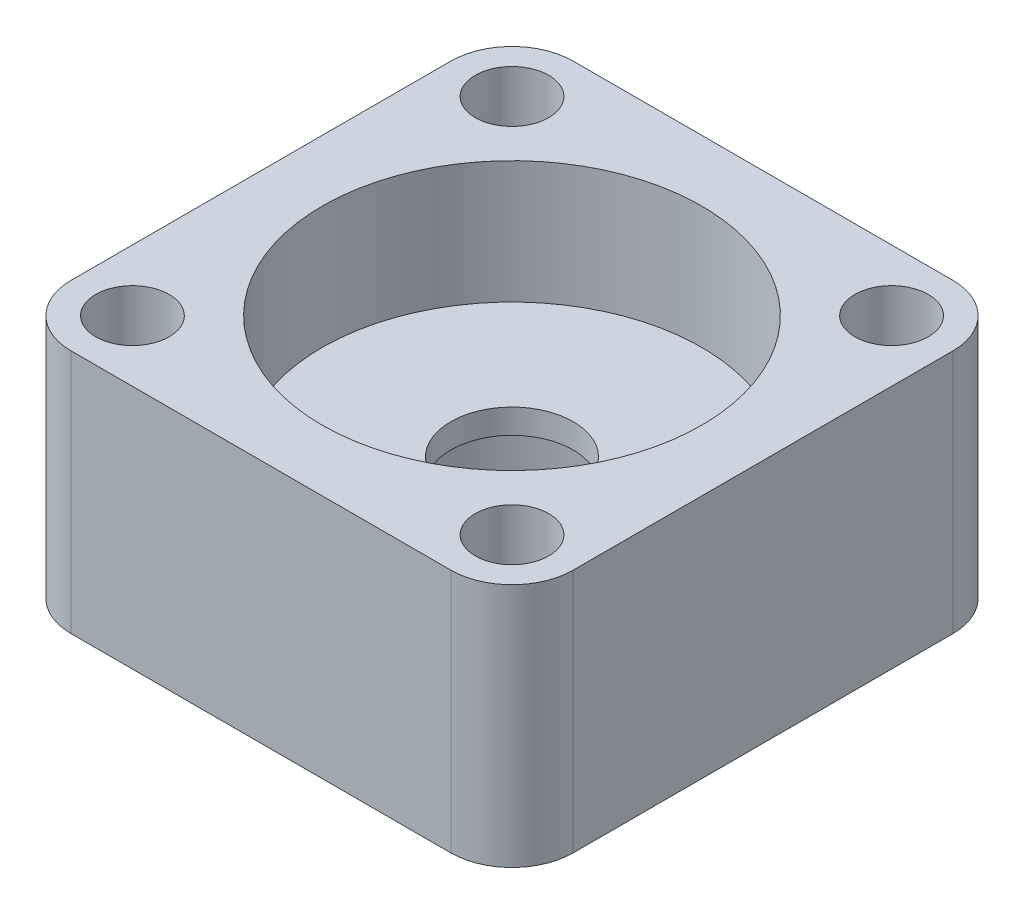
ISO-10303-21;
HEADER;
FILE_DESCRIPTION(('STEP AP214'),'2;1');
FILE_NAME('part.step','',(''),(''),'','','');
FILE_SCHEMA(('AUTOMOTIVE_DESIGN { 1 0 10303 214 1 1 1 1 }'));
ENDSEC;
DATA;
#1=APPLICATION_CONTEXT('core data for automotive mechanical design processes');
#2=APPLICATION_PROTOCOL_DEFINITION('international standard','automotive_design',2000,#1);
#3=PRODUCT_CONTEXT('',#1,'mechanical');
#4=PRODUCT('Part','Part','',(#3));
#5=PRODUCT_RELATED_PRODUCT_CATEGORY('part','',(#4));
#6=PRODUCT_DEFINITION_FORMATION('','',#4);
#7=PRODUCT_DEFINITION_CONTEXT('part definition',#1,'design');
#8=PRODUCT_DEFINITION('design','',#6,#7);
#9=PRODUCT_DEFINITION_SHAPE('','',#8);
#10=(LENGTH_UNIT() NAMED_UNIT(*) SI_UNIT(.MILLI.,.METRE.));
#11=(NAMED_UNIT(*) PLANE_ANGLE_UNIT() SI_UNIT($,.RADIAN.));
#12=(NAMED_UNIT(*) SI_UNIT($,.STERADIAN.) SOLID_ANGLE_UNIT());
#13=UNCERTAINTY_MEASURE_WITH_UNIT(LENGTH_MEASURE(1.E-05),#10,'distance_accuracy_value','');
#14=(GEOMETRIC_REPRESENTATION_CONTEXT(3) GLOBAL_UNCERTAINTY_ASSIGNED_CONTEXT((#13)) GLOBAL_UNIT_ASSIGNED_CONTEXT((#10,
#11,#12)) REPRESENTATION_CONTEXT('',''));
#15=CARTESIAN_POINT('',(0.,0.,0.));
#16=DIRECTION('',(0.,0.,1.));
#17=DIRECTION('',(1.,0.,0.));
#18=AXIS2_PLACEMENT_3D('',#15,#16,#17);
#19=CARTESIAN_POINT('',(-15.5,8.,-15.5));
#20=DIRECTION('',(0.,-1.,0.));
#21=DIRECTION('',(0.,0.,-1.));
#22=AXIS2_PLACEMENT_3D('',#19,#20,#21);
#23=CYLINDRICAL_SURFACE('',#22,1.75);
#24=CARTESIAN_POINT('',(-15.5,0.,-15.5));
#25=DIRECTION('',(0.,1.,0.));
#26=DIRECTION('',(0.,0.,1.));
#27=AXIS2_PLACEMENT_3D('',#24,#25,#26);
#28=CIRCLE('',#27,1.75);
#29=CARTESIAN_POINT('',(-15.5,0.,-13.75));
#30=VERTEX_POINT('',#29);
#31=EDGE_CURVE('E181',#30,#30,#28,.T.);
#32=ORIENTED_EDGE('',*,*,#31,.F.);
#33=EDGE_LOOP('',(#32));
#34=FACE_BOUND('',#33,.T.);
#35=CARTESIAN_POINT('',(-15.5,5.,-15.5));
#36=DIRECTION('',(0.,1.,0.));
#37=DIRECTION('',(0.,0.,1.));
#38=AXIS2_PLACEMENT_3D('',#35,#36,#37);
#39=CIRCLE('',#38,1.75);
#40=CARTESIAN_POINT('',(-15.5,5.,-13.75));
#41=VERTEX_POINT('',#40);
#42=EDGE_CURVE('E42',#41,#41,#39,.T.);
#43=ORIENTED_EDGE('',*,*,#42,.T.);
#44=EDGE_LOOP('',(#43));
#45=FACE_BOUND('',#44,.T.);
#46=ADVANCED_FACE('F38',(#34,#45),#23,.F.);
#47=CARTESIAN_POINT('',(15.5,8.,-15.5));
#48=DIRECTION('',(0.,-1.,0.));
#49=DIRECTION('',(0.,0.,-1.));
#50=AXIS2_PLACEMENT_3D('',#47,#48,#49);
#51=CYLINDRICAL_SURFACE('',#50,1.75);
#52=CARTESIAN_POINT('',(15.5,0.,-15.5));
#53=DIRECTION('',(0.,1.,0.));
#54=DIRECTION('',(0.,0.,1.));
#55=AXIS2_PLACEMENT_3D('',#52,#53,#54);
#56=CIRCLE('',#55,1.75);
#57=CARTESIAN_POINT('',(15.5,0.,-13.75));
#58=VERTEX_POINT('',#57);
#59=EDGE_CURVE('E177',#58,#58,#56,.T.);
#60=ORIENTED_EDGE('',*,*,#59,.F.);
#61=EDGE_LOOP('',(#60));
#62=FACE_BOUND('',#61,.T.);
#63=CARTESIAN_POINT('',(15.5,5.,-15.5));
#64=DIRECTION('',(0.,1.,0.));
#65=DIRECTION('',(0.,0.,1.));
#66=AXIS2_PLACEMENT_3D('',#63,#64,#65);
#67=CIRCLE('',#66,1.75);
#68=CARTESIAN_POINT('',(15.5,5.,-13.75));
#69=VERTEX_POINT('',#68);
#70=EDGE_CURVE('E244',#69,#69,#67,.T.);
#71=ORIENTED_EDGE('',*,*,#70,.T.);
#72=EDGE_LOOP('',(#71));
#73=FACE_BOUND('',#72,.T.);
#74=ADVANCED_FACE('F318',(#62,#73),#51,.F.);
#75=CARTESIAN_POINT('',(15.5,8.,15.5));
#76=DIRECTION('',(0.,-1.,0.));
#77=DIRECTION('',(0.,0.,-1.));
#78=AXIS2_PLACEMENT_3D('',#75,#76,#77);
#79=CYLINDRICAL_SURFACE('',#78,1.75);
#80=CARTESIAN_POINT('',(15.5,0.,15.5));
#81=DIRECTION('',(0.,1.,0.));
#82=DIRECTION('',(0.,0.,1.));
#83=AXIS2_PLACEMENT_3D('',#80,#81,#82);
#84=CIRCLE('',#83,1.75);
#85=CARTESIAN_POINT('',(15.5,0.,17.25));
#86=VERTEX_POINT('',#85);
#87=EDGE_CURVE('E173',#86,#86,#84,.T.);
#88=ORIENTED_EDGE('',*,*,#87,.F.);
#89=EDGE_LOOP('',(#88));
#90=FACE_BOUND('',#89,.T.);
#91=CARTESIAN_POINT('',(15.5,5.,15.5));
#92=DIRECTION('',(0.,1.,0.));
#93=DIRECTION('',(0.,0.,1.));
#94=AXIS2_PLACEMENT_3D('',#91,#92,#93);
#95=CIRCLE('',#94,1.75);
#96=CARTESIAN_POINT('',(15.5,5.,17.25));
#97=VERTEX_POINT('',#96);
#98=EDGE_CURVE('E240',#97,#97,#95,.T.);
#99=ORIENTED_EDGE('',*,*,#98,.T.);
#100=EDGE_LOOP('',(#99));
#101=FACE_BOUND('',#100,.T.);
#102=ADVANCED_FACE('F325',(#90,#101),#79,.F.);
#103=CARTESIAN_POINT('',(-15.5,8.,15.5));
#104=DIRECTION('',(0.,-1.,0.));
#105=DIRECTION('',(0.,0.,-1.));
#106=AXIS2_PLACEMENT_3D('',#103,#104,#105);
#107=CYLINDRICAL_SURFACE('',#106,1.75);
#108=CARTESIAN_POINT('',(-15.5,0.,15.5));
#109=DIRECTION('',(0.,1.,0.));
#110=DIRECTION('',(0.,0.,1.));
#111=AXIS2_PLACEMENT_3D('',#108,#109,#110);
#112=CIRCLE('',#111,1.75);
#113=CARTESIAN_POINT('',(-15.5,0.,17.25));
#114=VERTEX_POINT('',#113);
#115=EDGE_CURVE('E169',#114,#114,#112,.T.);
#116=ORIENTED_EDGE('',*,*,#115,.F.);
#117=EDGE_LOOP('',(#116));
#118=FACE_BOUND('',#117,.T.);
#119=CARTESIAN_POINT('',(-15.5,5.,15.5));
#120=DIRECTION('',(0.,1.,0.));
#121=DIRECTION('',(0.,0.,1.));
#122=AXIS2_PLACEMENT_3D('',#119,#120,#121);
#123=CIRCLE('',#122,1.75);
#124=CARTESIAN_POINT('',(-15.5,5.,17.25));
#125=VERTEX_POINT('',#124);
#126=EDGE_CURVE('E236',#125,#125,#123,.T.);
#127=ORIENTED_EDGE('',*,*,#126,.T.);
#128=EDGE_LOOP('',(#127));
#129=FACE_BOUND('',#128,.T.);
#130=ADVANCED_FACE('F378',(#118,#129),#107,.F.);
#131=CARTESIAN_POINT('',(-15.5,10.,-15.5));
#132=DIRECTION('',(0.,1.,0.));
#133=DIRECTION('',(0.,0.,1.));
#134=AXIS2_PLACEMENT_3D('',#131,#132,#133);
#135=PLANE('',#134);
#136=CARTESIAN_POINT('',(0.,10.,0.));
#137=DIRECTION('',(0.,1.,0.));
#138=DIRECTION('',(0.,0.,1.));
#139=AXIS2_PLACEMENT_3D('',#136,#137,#138);
#140=CIRCLE('',#139,5.);
#141=CARTESIAN_POINT('',(0.,10.,5.));
#142=VERTEX_POINT('',#141);
#143=EDGE_CURVE('E161',#142,#142,#140,.T.);
#144=ORIENTED_EDGE('',*,*,#143,.F.);
#145=EDGE_LOOP('',(#144));
#146=FACE_BOUND('',#145,.T.);
#147=CARTESIAN_POINT('',(0.,10.,0.));
#148=DIRECTION('',(0.,1.,0.));
#149=DIRECTION('',(0.,0.,1.));
#150=AXIS2_PLACEMENT_3D('',#147,#148,#149);
#151=CIRCLE('',#150,15.5);
#152=CARTESIAN_POINT('',(0.,10.,15.5));
#153=VERTEX_POINT('',#152);
#154=EDGE_CURVE('E11',#153,#153,#151,.F.);
#155=ORIENTED_EDGE('',*,*,#154,.F.);
#156=EDGE_LOOP('',(#155));
#157=FACE_BOUND('',#156,.T.);
#158=ADVANCED_FACE('F340',(#146,#157),#135,.T.);
#159=CARTESIAN_POINT('',(-15.5,0.,-15.5));
#160=DIRECTION('',(0.,1.,0.));
#161=DIRECTION('',(0.,0.,1.));
#162=AXIS2_PLACEMENT_3D('',#159,#160,#161);
#163=PLANE('',#162);
#164=CARTESIAN_POINT('',(-15.5,0.,-15.5));
#165=DIRECTION('',(0.,1.,0.));
#166=DIRECTION('',(0.,0.,1.));
#167=AXIS2_PLACEMENT_3D('',#164,#165,#166);
#168=CIRCLE('',#167,5.);
#169=CARTESIAN_POINT('',(-15.5,0.,-20.5));
#170=VERTEX_POINT('',#169);
#171=CARTESIAN_POINT('',(-20.5,0.,-15.5));
#172=VERTEX_POINT('',#171);
#173=EDGE_CURVE('E112',#170,#172,#168,.T.);
#174=ORIENTED_EDGE('',*,*,#173,.F.);
#175=DIRECTION('',(-1.,0.,0.));
#176=VECTOR('',#175,1.);
#177=CARTESIAN_POINT('',(-15.5,0.,-20.5));
#178=LINE('',#177,#176);
#179=CARTESIAN_POINT('',(15.5,0.,-20.5));
#180=VERTEX_POINT('',#179);
#181=EDGE_CURVE('E56',#180,#170,#178,.T.);
#182=ORIENTED_EDGE('',*,*,#181,.F.);
#183=CARTESIAN_POINT('',(15.5,0.,-15.5));
#184=DIRECTION('',(0.,1.,0.));
#185=DIRECTION('',(0.,0.,1.));
#186=AXIS2_PLACEMENT_3D('',#183,#184,#185);
#187=CIRCLE('',#186,4.99999999999999);
#188=CARTESIAN_POINT('',(20.5,0.,-15.5));
#189=VERTEX_POINT('',#188);
#190=EDGE_CURVE('E64',#189,#180,#187,.T.);
#191=ORIENTED_EDGE('',*,*,#190,.F.);
#192=DIRECTION('',(0.,0.,-1.));
#193=VECTOR('',#192,1.);
#194=CARTESIAN_POINT('',(20.5,0.,-15.5));
#195=LINE('',#194,#193);
#196=CARTESIAN_POINT('',(20.5,0.,15.5));
#197=VERTEX_POINT('',#196);
#198=EDGE_CURVE('E206',#197,#189,#195,.T.);
#199=ORIENTED_EDGE('',*,*,#198,.F.);
#200=CARTESIAN_POINT('',(15.5,0.,15.5));
#201=DIRECTION('',(0.,1.,0.));
#202=DIRECTION('',(0.,0.,1.));
#203=AXIS2_PLACEMENT_3D('',#200,#201,#202);
#204=CIRCLE('',#203,5.);
#205=CARTESIAN_POINT('',(15.5,0.,20.5));
#206=VERTEX_POINT('',#205);
#207=EDGE_CURVE('E203',#206,#197,#204,.T.);
#208=ORIENTED_EDGE('',*,*,#207,.F.);
#209=DIRECTION('',(1.,0.,0.));
#210=VECTOR('',#209,1.);
#211=CARTESIAN_POINT('',(-15.5,0.,20.5));
#212=LINE('',#211,#210);
#213=CARTESIAN_POINT('',(-15.5,0.,20.5));
#214=VERTEX_POINT('',#213);
#215=EDGE_CURVE('E200',#214,#206,#212,.T.);
#216=ORIENTED_EDGE('',*,*,#215,.F.);
#217=CARTESIAN_POINT('',(-15.5,0.,15.5));
#218=DIRECTION('',(0.,1.,0.));
#219=DIRECTION('',(0.,0.,1.));
#220=AXIS2_PLACEMENT_3D('',#217,#218,#219);
#221=CIRCLE('',#220,5.);
#222=CARTESIAN_POINT('',(-20.5,0.,15.5));
#223=VERTEX_POINT('',#222);
#224=EDGE_CURVE('E197',#223,#214,#221,.T.);
#225=ORIENTED_EDGE('',*,*,#224,.F.);
#226=DIRECTION('',(0.,0.,1.));
#227=VECTOR('',#226,1.);
#228=CARTESIAN_POINT('',(-20.5,0.,-15.5));
#229=LINE('',#228,#227);
#230=EDGE_CURVE('E194',#172,#223,#229,.T.);
#231=ORIENTED_EDGE('',*,*,#230,.F.);
#232=EDGE_LOOP('',(#174,#182,#191,#199,#208,#216,#225,#231));
#233=FACE_BOUND('',#232,.T.);
#234=CARTESIAN_POINT('',(0.,0.,0.));
#235=DIRECTION('',(0.,1.,0.));
#236=DIRECTION('',(0.,0.,1.));
#237=AXIS2_PLACEMENT_3D('',#234,#235,#236);
#238=CIRCLE('',#237,11.);
#239=CARTESIAN_POINT('',(0.,0.,11.));
#240=VERTEX_POINT('',#239);
#241=EDGE_CURVE('E185',#240,#240,#238,.T.);
#242=ORIENTED_EDGE('',*,*,#241,.T.);
#243=EDGE_LOOP('',(#242));
#244=FACE_BOUND('',#243,.T.);
#245=ORIENTED_EDGE('',*,*,#31,.T.);
#246=EDGE_LOOP('',(#245));
#247=FACE_BOUND('',#246,.T.);
#248=ORIENTED_EDGE('',*,*,#59,.T.);
#249=EDGE_LOOP('',(#248));
#250=FACE_BOUND('',#249,.T.);
#251=ORIENTED_EDGE('',*,*,#87,.T.);
#252=EDGE_LOOP('',(#251));
#253=FACE_BOUND('',#252,.T.);
#254=ORIENTED_EDGE('',*,*,#115,.T.);
#255=EDGE_LOOP('',(#254));
#256=FACE_BOUND('',#255,.T.);
#257=ADVANCED_FACE('F337',(#233,#244,#247,#250,#253,#256),#163,.F.);
#258=CARTESIAN_POINT('',(-15.5,8.,-15.5));
#259=DIRECTION('',(0.,-1.,0.));
#260=DIRECTION('',(0.,0.,-1.));
#261=AXIS2_PLACEMENT_3D('',#258,#259,#260);
#262=CYLINDRICAL_SURFACE('',#261,5.);
#263=ORIENTED_EDGE('',*,*,#173,.T.);
#264=DIRECTION('',(0.,-1.,0.));
#265=VECTOR('',#264,1.);
#266=CARTESIAN_POINT('',(-20.5,8.,-15.5));
#267=LINE('',#266,#265);
#268=CARTESIAN_POINT('',(-20.5,20.,-15.5));
#269=VERTEX_POINT('',#268);
#270=EDGE_CURVE('E48',#269,#172,#267,.T.);
#271=ORIENTED_EDGE('',*,*,#270,.F.);
#272=CARTESIAN_POINT('',(-15.5,20.,-15.5));
#273=DIRECTION('',(0.,1.,0.));
#274=DIRECTION('',(0.,0.,1.));
#275=AXIS2_PLACEMENT_3D('',#272,#273,#274);
#276=CIRCLE('',#275,5.);
#277=CARTESIAN_POINT('',(-15.5,20.,-20.5));
#278=VERTEX_POINT('',#277);
#279=EDGE_CURVE('E110',#278,#269,#276,.T.);
#280=ORIENTED_EDGE('',*,*,#279,.F.);
#281=DIRECTION('',(0.,-1.,0.));
#282=VECTOR('',#281,1.);
#283=CARTESIAN_POINT('',(-15.5,8.,-20.5));
#284=LINE('',#283,#282);
#285=EDGE_CURVE('E213',#278,#170,#284,.T.);
#286=ORIENTED_EDGE('',*,*,#285,.T.);
#287=EDGE_LOOP('',(#263,#271,#280,#286));
#288=FACE_BOUND('',#287,.T.);
#289=ADVANCED_FACE('F40',(#288),#262,.T.);
#290=CARTESIAN_POINT('',(-20.5,8.,-15.5));
#291=DIRECTION('',(1.,0.,0.));
#292=DIRECTION('',(0.,0.,-1.));
#293=AXIS2_PLACEMENT_3D('',#290,#291,#292);
#294=PLANE('',#293);
#295=ORIENTED_EDGE('',*,*,#230,.T.);
#296=DIRECTION('',(0.,-1.,0.));
#297=VECTOR('',#296,1.);
#298=CARTESIAN_POINT('',(-20.5,8.,15.5));
#299=LINE('',#298,#297);
#300=CARTESIAN_POINT('',(-20.5,20.,15.5));
#301=VERTEX_POINT('',#300);
#302=EDGE_CURVE('E115',#301,#223,#299,.T.);
#303=ORIENTED_EDGE('',*,*,#302,.F.);
#304=DIRECTION('',(0.,0.,1.));
#305=VECTOR('',#304,1.);
#306=CARTESIAN_POINT('',(-20.5,20.,-15.5));
#307=LINE('',#306,#305);
#308=EDGE_CURVE('E118',#269,#301,#307,.T.);
#309=ORIENTED_EDGE('',*,*,#308,.F.);
#310=ORIENTED_EDGE('',*,*,#270,.T.);
#311=EDGE_LOOP('',(#295,#303,#309,#310));
#312=FACE_BOUND('',#311,.T.);
#313=ADVANCED_FACE('F119',(#312),#294,.F.);
#314=CARTESIAN_POINT('',(-15.5,8.,15.5));
#315=DIRECTION('',(0.,-1.,0.));
#316=DIRECTION('',(0.,0.,-1.));
#317=AXIS2_PLACEMENT_3D('',#314,#315,#316);
#318=CYLINDRICAL_SURFACE('',#317,5.);
#319=ORIENTED_EDGE('',*,*,#224,.T.);
#320=DIRECTION('',(0.,-1.,0.));
#321=VECTOR('',#320,1.);
#322=CARTESIAN_POINT('',(-15.5,8.,20.5));
#323=LINE('',#322,#321);
#324=CARTESIAN_POINT('',(-15.5,20.,20.5));
#325=VERTEX_POINT('',#324);
#326=EDGE_CURVE('E230',#325,#214,#323,.T.);
#327=ORIENTED_EDGE('',*,*,#326,.F.);
#328=CARTESIAN_POINT('',(-15.5,20.,15.5));
#329=DIRECTION('',(0.,1.,0.));
#330=DIRECTION('',(0.,0.,1.));
#331=AXIS2_PLACEMENT_3D('',#328,#329,#330);
#332=CIRCLE('',#331,5.);
#333=EDGE_CURVE('E125',#301,#325,#332,.T.);
#334=ORIENTED_EDGE('',*,*,#333,.F.);
#335=ORIENTED_EDGE('',*,*,#302,.T.);
#336=EDGE_LOOP('',(#319,#327,#334,#335));
#337=FACE_BOUND('',#336,.T.);
#338=ADVANCED_FACE('F358',(#337),#318,.T.);
#339=CARTESIAN_POINT('',(-15.5,8.,20.5));
#340=DIRECTION('',(0.,0.,-1.));
#341=DIRECTION('',(-1.,0.,0.));
#342=AXIS2_PLACEMENT_3D('',#339,#340,#341);
#343=PLANE('',#342);
#344=ORIENTED_EDGE('',*,*,#215,.T.);
#345=DIRECTION('',(0.,-1.,0.));
#346=VECTOR('',#345,1.);
#347=CARTESIAN_POINT('',(15.5,8.,20.5));
#348=LINE('',#347,#346);
#349=CARTESIAN_POINT('',(15.5,20.,20.5));
#350=VERTEX_POINT('',#349);
#351=EDGE_CURVE('E226',#350,#206,#348,.T.);
#352=ORIENTED_EDGE('',*,*,#351,.F.);
#353=DIRECTION('',(1.,0.,0.));
#354=VECTOR('',#353,1.);
#355=CARTESIAN_POINT('',(-15.5,20.,20.5));
#356=LINE('',#355,#354);
#357=EDGE_CURVE('E143',#325,#350,#356,.T.);
#358=ORIENTED_EDGE('',*,*,#357,.F.);
#359=ORIENTED_EDGE('',*,*,#326,.T.);
#360=EDGE_LOOP('',(#344,#352,#358,#359));
#361=FACE_BOUND('',#360,.T.);
#362=ADVANCED_FACE('F354',(#361),#343,.F.);
#363=CARTESIAN_POINT('',(15.5,8.,15.5));
#364=DIRECTION('',(0.,-1.,0.));
#365=DIRECTION('',(0.,0.,-1.));
#366=AXIS2_PLACEMENT_3D('',#363,#364,#365);
#367=CYLINDRICAL_SURFACE('',#366,5.);
#368=ORIENTED_EDGE('',*,*,#207,.T.);
#369=DIRECTION('',(0.,-1.,0.));
#370=VECTOR('',#369,1.);
#371=CARTESIAN_POINT('',(20.5,8.,15.5));
#372=LINE('',#371,#370);
#373=CARTESIAN_POINT('',(20.5,20.,15.5));
#374=VERTEX_POINT('',#373);
#375=EDGE_CURVE('E222',#374,#197,#372,.T.);
#376=ORIENTED_EDGE('',*,*,#375,.F.);
#377=CARTESIAN_POINT('',(15.5,20.,15.5));
#378=DIRECTION('',(0.,1.,0.));
#379=DIRECTION('',(0.,0.,1.));
#380=AXIS2_PLACEMENT_3D('',#377,#378,#379);
#381=CIRCLE('',#380,5.);
#382=EDGE_CURVE('E147',#350,#374,#381,.T.);
#383=ORIENTED_EDGE('',*,*,#382,.F.);
#384=ORIENTED_EDGE('',*,*,#351,.T.);
#385=EDGE_LOOP('',(#368,#376,#383,#384));
#386=FACE_BOUND('',#385,.T.);
#387=ADVANCED_FACE('F350',(#386),#367,.T.);
#388=CARTESIAN_POINT('',(20.5,8.,-15.5));
#389=DIRECTION('',(-1.,0.,0.));
#390=DIRECTION('',(0.,0.,1.));
#391=AXIS2_PLACEMENT_3D('',#388,#389,#390);
#392=PLANE('',#391);
#393=ORIENTED_EDGE('',*,*,#198,.T.);
#394=DIRECTION('',(0.,-1.,0.));
#395=VECTOR('',#394,1.);
#396=CARTESIAN_POINT('',(20.5,8.,-15.5));
#397=LINE('',#396,#395);
#398=CARTESIAN_POINT('',(20.5,20.,-15.5));
#399=VERTEX_POINT('',#398);
#400=EDGE_CURVE('E219',#399,#189,#397,.T.);
#401=ORIENTED_EDGE('',*,*,#400,.F.);
#402=DIRECTION('',(0.,0.,-1.));
#403=VECTOR('',#402,1.);
#404=CARTESIAN_POINT('',(20.5,20.,15.5));
#405=LINE('',#404,#403);
#406=EDGE_CURVE('E151',#374,#399,#405,.T.);
#407=ORIENTED_EDGE('',*,*,#406,.F.);
#408=ORIENTED_EDGE('',*,*,#375,.T.);
#409=EDGE_LOOP('',(#393,#401,#407,#408));
#410=FACE_BOUND('',#409,.T.);
#411=ADVANCED_FACE('F347',(#410),#392,.F.);
#412=CARTESIAN_POINT('',(15.5,8.,-15.5));
#413=DIRECTION('',(0.,-1.,0.));
#414=DIRECTION('',(0.,0.,-1.));
#415=AXIS2_PLACEMENT_3D('',#412,#413,#414);
#416=CYLINDRICAL_SURFACE('',#415,4.99999999999999);
#417=ORIENTED_EDGE('',*,*,#190,.T.);
#418=DIRECTION('',(0.,-1.,0.));
#419=VECTOR('',#418,1.);
#420=CARTESIAN_POINT('',(15.5,8.,-20.5));
#421=LINE('',#420,#419);
#422=CARTESIAN_POINT('',(15.5,20.,-20.5));
#423=VERTEX_POINT('',#422);
#424=EDGE_CURVE('E216',#423,#180,#421,.T.);
#425=ORIENTED_EDGE('',*,*,#424,.F.);
#426=CARTESIAN_POINT('',(15.5,20.,-15.5));
#427=DIRECTION('',(0.,1.,0.));
#428=DIRECTION('',(0.,0.,1.));
#429=AXIS2_PLACEMENT_3D('',#426,#427,#428);
#430=CIRCLE('',#429,4.99999999999999);
#431=EDGE_CURVE('E155',#399,#423,#430,.T.);
#432=ORIENTED_EDGE('',*,*,#431,.F.);
#433=ORIENTED_EDGE('',*,*,#400,.T.);
#434=EDGE_LOOP('',(#417,#425,#432,#433));
#435=FACE_BOUND('',#434,.T.);
#436=ADVANCED_FACE('F344',(#435),#416,.T.);
#437=CARTESIAN_POINT('',(-15.5,8.,-20.5));
#438=DIRECTION('',(0.,0.,1.));
#439=DIRECTION('',(1.,0.,0.));
#440=AXIS2_PLACEMENT_3D('',#437,#438,#439);
#441=PLANE('',#440);
#442=ORIENTED_EDGE('',*,*,#181,.T.);
#443=ORIENTED_EDGE('',*,*,#285,.F.);
#444=DIRECTION('',(-1.,0.,0.));
#445=VECTOR('',#444,1.);
#446=CARTESIAN_POINT('',(15.5,20.,-20.5));
#447=LINE('',#446,#445);
#448=EDGE_CURVE('E132',#423,#278,#447,.T.);
#449=ORIENTED_EDGE('',*,*,#448,.F.);
#450=ORIENTED_EDGE('',*,*,#424,.T.);
#451=EDGE_LOOP('',(#442,#443,#449,#450));
#452=FACE_BOUND('',#451,.T.);
#453=ADVANCED_FACE('F335',(#452),#441,.F.);
#454=CARTESIAN_POINT('',(0.,8.,0.));
#455=DIRECTION('',(0.,-1.,0.));
#456=DIRECTION('',(0.,0.,-1.));
#457=AXIS2_PLACEMENT_3D('',#454,#455,#456);
#458=CYLINDRICAL_SURFACE('',#457,11.);
#459=CARTESIAN_POINT('',(0.,8.,0.));
#460=DIRECTION('',(0.,1.,0.));
#461=DIRECTION('',(0.,0.,1.));
#462=AXIS2_PLACEMENT_3D('',#459,#460,#461);
#463=CIRCLE('',#462,11.);
#464=CARTESIAN_POINT('',(0.,8.,11.));
#465=VERTEX_POINT('',#464);
#466=EDGE_CURVE('E165',#465,#465,#463,.T.);
#467=ORIENTED_EDGE('',*,*,#466,.T.);
#468=EDGE_LOOP('',(#467));
#469=FACE_BOUND('',#468,.T.);
#470=ORIENTED_EDGE('',*,*,#241,.F.);
#471=EDGE_LOOP('',(#470));
#472=FACE_BOUND('',#471,.T.);
#473=ADVANCED_FACE('F331',(#469,#472),#458,.F.);
#474=CARTESIAN_POINT('',(-15.5,8.,-15.5));
#475=DIRECTION('',(0.,1.,0.));
#476=DIRECTION('',(0.,0.,1.));
#477=AXIS2_PLACEMENT_3D('',#474,#475,#476);
#478=PLANE('',#477);
#479=CARTESIAN_POINT('',(0.,8.,0.));
#480=DIRECTION('',(0.,1.,0.));
#481=DIRECTION('',(0.,0.,1.));
#482=AXIS2_PLACEMENT_3D('',#479,#480,#481);
#483=CIRCLE('',#482,5.);
#484=CARTESIAN_POINT('',(0.,8.,5.));
#485=VERTEX_POINT('',#484);
#486=EDGE_CURVE('E160',#485,#485,#483,.T.);
#487=ORIENTED_EDGE('',*,*,#486,.T.);
#488=EDGE_LOOP('',(#487));
#489=FACE_BOUND('',#488,.T.);
#490=ORIENTED_EDGE('',*,*,#466,.F.);
#491=EDGE_LOOP('',(#490));
#492=FACE_BOUND('',#491,.T.);
#493=ADVANCED_FACE('F334',(#489,#492),#478,.F.);
#494=CARTESIAN_POINT('',(0.,10.,0.));
#495=DIRECTION('',(0.,-1.,0.));
#496=DIRECTION('',(0.,0.,-1.));
#497=AXIS2_PLACEMENT_3D('',#494,#495,#496);
#498=CYLINDRICAL_SURFACE('',#497,5.);
#499=ORIENTED_EDGE('',*,*,#143,.T.);
#500=EDGE_LOOP('',(#499));
#501=FACE_BOUND('',#500,.T.);
#502=ORIENTED_EDGE('',*,*,#486,.F.);
#503=EDGE_LOOP('',(#502));
#504=FACE_BOUND('',#503,.T.);
#505=ADVANCED_FACE('F304',(#501,#504),#498,.F.);
#506=CARTESIAN_POINT('',(-15.5,20.,-15.5));
#507=DIRECTION('',(0.,1.,0.));
#508=DIRECTION('',(0.,0.,1.));
#509=AXIS2_PLACEMENT_3D('',#506,#507,#508);
#510=PLANE('',#509);
#511=CARTESIAN_POINT('',(-15.5,20.,15.5));
#512=DIRECTION('',(0.,1.,0.));
#513=DIRECTION('',(0.,0.,1.));
#514=AXIS2_PLACEMENT_3D('',#511,#512,#513);
#515=CIRCLE('',#514,3.);
#516=CARTESIAN_POINT('',(-15.5,20.,18.5));
#517=VERTEX_POINT('',#516);
#518=EDGE_CURVE('E270',#517,#517,#515,.T.);
#519=ORIENTED_EDGE('',*,*,#518,.F.);
#520=EDGE_LOOP('',(#519));
#521=FACE_BOUND('',#520,.T.);
#522=CARTESIAN_POINT('',(15.5,20.,15.5));
#523=DIRECTION('',(0.,1.,0.));
#524=DIRECTION('',(0.,0.,1.));
#525=AXIS2_PLACEMENT_3D('',#522,#523,#524);
#526=CIRCLE('',#525,3.);
#527=CARTESIAN_POINT('',(15.5,20.,18.5));
#528=VERTEX_POINT('',#527);
#529=EDGE_CURVE('E278',#528,#528,#526,.T.);
#530=ORIENTED_EDGE('',*,*,#529,.F.);
#531=EDGE_LOOP('',(#530));
#532=FACE_BOUND('',#531,.T.);
#533=CARTESIAN_POINT('',(15.5,20.,-15.5));
#534=DIRECTION('',(0.,1.,0.));
#535=DIRECTION('',(0.,0.,1.));
#536=AXIS2_PLACEMENT_3D('',#533,#534,#535);
#537=CIRCLE('',#536,3.);
#538=CARTESIAN_POINT('',(15.5,20.,-12.5));
#539=VERTEX_POINT('',#538);
#540=EDGE_CURVE('E286',#539,#539,#537,.T.);
#541=ORIENTED_EDGE('',*,*,#540,.F.);
#542=EDGE_LOOP('',(#541));
#543=FACE_BOUND('',#542,.T.);
#544=CARTESIAN_POINT('',(-15.5,20.,-15.5));
#545=DIRECTION('',(0.,1.,0.));
#546=DIRECTION('',(0.,0.,1.));
#547=AXIS2_PLACEMENT_3D('',#544,#545,#546);
#548=CIRCLE('',#547,3.);
#549=CARTESIAN_POINT('',(-15.5,20.,-12.5));
#550=VERTEX_POINT('',#549);
#551=EDGE_CURVE('E264',#550,#550,#548,.T.);
#552=ORIENTED_EDGE('',*,*,#551,.F.);
#553=EDGE_LOOP('',(#552));
#554=FACE_BOUND('',#553,.T.);
#555=ORIENTED_EDGE('',*,*,#279,.T.);
#556=ORIENTED_EDGE('',*,*,#308,.T.);
#557=ORIENTED_EDGE('',*,*,#333,.T.);
#558=ORIENTED_EDGE('',*,*,#357,.T.);
#559=ORIENTED_EDGE('',*,*,#382,.T.);
#560=ORIENTED_EDGE('',*,*,#406,.T.);
#561=ORIENTED_EDGE('',*,*,#431,.T.);
#562=ORIENTED_EDGE('',*,*,#448,.T.);
#563=EDGE_LOOP('',(#555,#556,#557,#558,#559,#560,#561,#562));
#564=FACE_BOUND('',#563,.T.);
#565=CARTESIAN_POINT('',(0.,20.,0.));
#566=DIRECTION('',(0.,1.,0.));
#567=DIRECTION('',(0.,0.,1.));
#568=AXIS2_PLACEMENT_3D('',#565,#566,#567);
#569=CIRCLE('',#568,15.5);
#570=CARTESIAN_POINT('',(0.,20.,15.5));
#571=VERTEX_POINT('',#570);
#572=EDGE_CURVE('E134',#571,#571,#569,.T.);
#573=ORIENTED_EDGE('',*,*,#572,.F.);
#574=EDGE_LOOP('',(#573));
#575=FACE_BOUND('',#574,.T.);
#576=ADVANCED_FACE('F128',(#521,#532,#543,#554,#564,#575),#510,.T.);
#577=CARTESIAN_POINT('',(0.,20.,0.));
#578=DIRECTION('',(0.,-1.,0.));
#579=DIRECTION('',(0.,0.,-1.));
#580=AXIS2_PLACEMENT_3D('',#577,#578,#579);
#581=CYLINDRICAL_SURFACE('',#580,15.5);
#582=ORIENTED_EDGE('',*,*,#572,.T.);
#583=EDGE_LOOP('',(#582));
#584=FACE_BOUND('',#583,.T.);
#585=ORIENTED_EDGE('',*,*,#154,.T.);
#586=EDGE_LOOP('',(#585));
#587=FACE_BOUND('',#586,.T.);
#588=ADVANCED_FACE('F303',(#584,#587),#581,.F.);
#589=CARTESIAN_POINT('',(-15.5,5.,-15.5));
#590=DIRECTION('',(0.,1.,0.));
#591=DIRECTION('',(0.,0.,1.));
#592=AXIS2_PLACEMENT_3D('',#589,#590,#591);
#593=CYLINDRICAL_SURFACE('',#592,3.);
#594=CARTESIAN_POINT('',(-15.5,5.,-15.5));
#595=DIRECTION('',(0.,1.,0.));
#596=DIRECTION('',(0.,0.,1.));
#597=AXIS2_PLACEMENT_3D('',#594,#595,#596);
#598=CIRCLE('',#597,3.);
#599=CARTESIAN_POINT('',(-15.5,5.,-12.5));
#600=VERTEX_POINT('',#599);
#601=EDGE_CURVE('E241',#600,#600,#598,.T.);
#602=ORIENTED_EDGE('',*,*,#601,.F.);
#603=EDGE_LOOP('',(#602));
#604=FACE_BOUND('',#603,.T.);
#605=ORIENTED_EDGE('',*,*,#551,.T.);
#606=EDGE_LOOP('',(#605));
#607=FACE_BOUND('',#606,.T.);
#608=ADVANCED_FACE('F258',(#604,#607),#593,.F.);
#609=CARTESIAN_POINT('',(-15.5,5.,-15.5));
#610=DIRECTION('',(0.,1.,0.));
#611=DIRECTION('',(0.,0.,1.));
#612=AXIS2_PLACEMENT_3D('',#609,#610,#611);
#613=PLANE('',#612);
#614=ORIENTED_EDGE('',*,*,#42,.F.);
#615=EDGE_LOOP('',(#614));
#616=FACE_BOUND('',#615,.T.);
#617=ORIENTED_EDGE('',*,*,#601,.T.);
#618=EDGE_LOOP('',(#617));
#619=FACE_BOUND('',#618,.T.);
#620=ADVANCED_FACE('F254',(#616,#619),#613,.T.);
#621=CARTESIAN_POINT('',(15.5,5.,-15.5));
#622=DIRECTION('',(0.,1.,0.));
#623=DIRECTION('',(0.,0.,1.));
#624=AXIS2_PLACEMENT_3D('',#621,#622,#623);
#625=CYLINDRICAL_SURFACE('',#624,3.);
#626=CARTESIAN_POINT('',(15.5,5.,-15.5));
#627=DIRECTION('',(0.,1.,0.));
#628=DIRECTION('',(0.,0.,1.));
#629=AXIS2_PLACEMENT_3D('',#626,#627,#628);
#630=CIRCLE('',#629,3.);
#631=CARTESIAN_POINT('',(15.5,5.,-12.5));
#632=VERTEX_POINT('',#631);
#633=EDGE_CURVE('E268',#632,#632,#630,.T.);
#634=ORIENTED_EDGE('',*,*,#633,.F.);
#635=EDGE_LOOP('',(#634));
#636=FACE_BOUND('',#635,.T.);
#637=ORIENTED_EDGE('',*,*,#540,.T.);
#638=EDGE_LOOP('',(#637));
#639=FACE_BOUND('',#638,.T.);
#640=ADVANCED_FACE('F257',(#636,#639),#625,.F.);
#641=CARTESIAN_POINT('',(15.5,5.,-15.5));
#642=DIRECTION('',(0.,1.,0.));
#643=DIRECTION('',(0.,0.,1.));
#644=AXIS2_PLACEMENT_3D('',#641,#642,#643);
#645=PLANE('',#644);
#646=ORIENTED_EDGE('',*,*,#70,.F.);
#647=EDGE_LOOP('',(#646));
#648=FACE_BOUND('',#647,.T.);
#649=ORIENTED_EDGE('',*,*,#633,.T.);
#650=EDGE_LOOP('',(#649));
#651=FACE_BOUND('',#650,.T.);
#652=ADVANCED_FACE('F294',(#648,#651),#645,.T.);
#653=CARTESIAN_POINT('',(15.5,5.,15.5));
#654=DIRECTION('',(0.,1.,0.));
#655=DIRECTION('',(0.,0.,1.));
#656=AXIS2_PLACEMENT_3D('',#653,#654,#655);
#657=CYLINDRICAL_SURFACE('',#656,3.);
#658=CARTESIAN_POINT('',(15.5,5.,15.5));
#659=DIRECTION('',(0.,1.,0.));
#660=DIRECTION('',(0.,0.,1.));
#661=AXIS2_PLACEMENT_3D('',#658,#659,#660);
#662=CIRCLE('',#661,3.);
#663=CARTESIAN_POINT('',(15.5,5.,18.5));
#664=VERTEX_POINT('',#663);
#665=EDGE_CURVE('E282',#664,#664,#662,.T.);
#666=ORIENTED_EDGE('',*,*,#665,.F.);
#667=EDGE_LOOP('',(#666));
#668=FACE_BOUND('',#667,.T.);
#669=ORIENTED_EDGE('',*,*,#529,.T.);
#670=EDGE_LOOP('',(#669));
#671=FACE_BOUND('',#670,.T.);
#672=ADVANCED_FACE('F573',(#668,#671),#657,.F.);
#673=CARTESIAN_POINT('',(15.5,5.,15.5));
#674=DIRECTION('',(0.,1.,0.));
#675=DIRECTION('',(0.,0.,1.));
#676=AXIS2_PLACEMENT_3D('',#673,#674,#675);
#677=PLANE('',#676);
#678=ORIENTED_EDGE('',*,*,#98,.F.);
#679=EDGE_LOOP('',(#678));
#680=FACE_BOUND('',#679,.T.);
#681=ORIENTED_EDGE('',*,*,#665,.T.);
#682=EDGE_LOOP('',(#681));
#683=FACE_BOUND('',#682,.T.);
#684=ADVANCED_FACE('F582',(#680,#683),#677,.T.);
#685=CARTESIAN_POINT('',(-15.5,5.,15.5));
#686=DIRECTION('',(0.,1.,0.));
#687=DIRECTION('',(0.,0.,1.));
#688=AXIS2_PLACEMENT_3D('',#685,#686,#687);
#689=CYLINDRICAL_SURFACE('',#688,3.);
#690=CARTESIAN_POINT('',(-15.5,5.,15.5));
#691=DIRECTION('',(0.,1.,0.));
#692=DIRECTION('',(0.,0.,1.));
#693=AXIS2_PLACEMENT_3D('',#690,#691,#692);
#694=CIRCLE('',#693,3.);
#695=CARTESIAN_POINT('',(-15.5,5.,18.5));
#696=VERTEX_POINT('',#695);
#697=EDGE_CURVE('E274',#696,#696,#694,.T.);
#698=ORIENTED_EDGE('',*,*,#697,.F.);
#699=EDGE_LOOP('',(#698));
#700=FACE_BOUND('',#699,.T.);
#701=ORIENTED_EDGE('',*,*,#518,.T.);
#702=EDGE_LOOP('',(#701));
#703=FACE_BOUND('',#702,.T.);
#704=ADVANCED_FACE('F591',(#700,#703),#689,.F.);
#705=CARTESIAN_POINT('',(-15.5,5.,15.5));
#706=DIRECTION('',(0.,1.,0.));
#707=DIRECTION('',(0.,0.,1.));
#708=AXIS2_PLACEMENT_3D('',#705,#706,#707);
#709=PLANE('',#708);
#710=ORIENTED_EDGE('',*,*,#126,.F.);
#711=EDGE_LOOP('',(#710));
#712=FACE_BOUND('',#711,.T.);
#713=ORIENTED_EDGE('',*,*,#697,.T.);
#714=EDGE_LOOP('',(#713));
#715=FACE_BOUND('',#714,.T.);
#716=ADVANCED_FACE('F600',(#712,#715),#709,.T.);
#717=CLOSED_SHELL('',(#46,#74,#102,#130,#158,#257,#289,#313,#338,#362,#387,#411,#436,#453,#473,
#493,#505,#576,#588,#608,#620,#640,#652,#672,#684,#704,#716));
#718=MANIFOLD_SOLID_BREP('B2',#717);
#719=ADVANCED_BREP_SHAPE_REPRESENTATION('',(#18,#718),#14);
#720=SHAPE_DEFINITION_REPRESENTATION(#9,#719);
ENDSEC;
END-ISO-10303-21;
